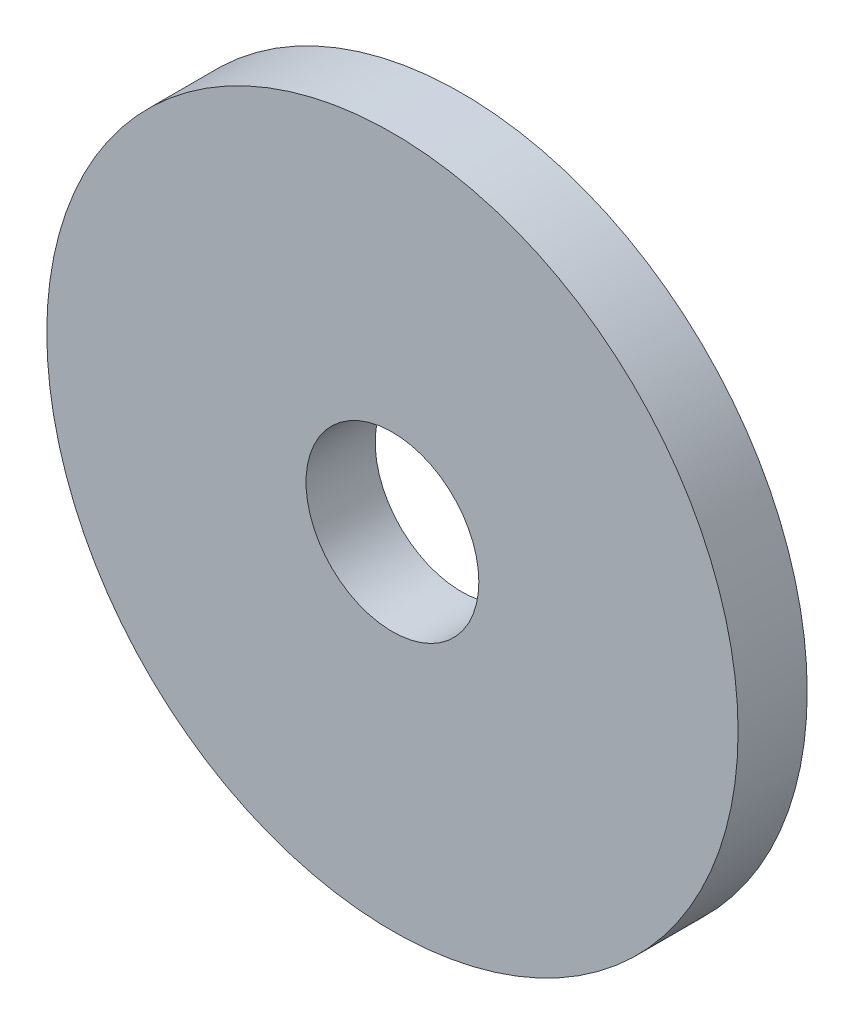
ISO-10303-21;
HEADER;
FILE_DESCRIPTION(('STEP AP214'),'2;1');
FILE_NAME('part.step','',(''),(''),'','','');
FILE_SCHEMA(('AUTOMOTIVE_DESIGN { 1 0 10303 214 1 1 1 1 }'));
ENDSEC;
DATA;
#1=APPLICATION_CONTEXT('core data for automotive mechanical design processes');
#2=APPLICATION_PROTOCOL_DEFINITION('international standard','automotive_design',2000,#1);
#3=PRODUCT_CONTEXT('',#1,'mechanical');
#4=PRODUCT('Part','Part','',(#3));
#5=PRODUCT_RELATED_PRODUCT_CATEGORY('part','',(#4));
#6=PRODUCT_DEFINITION_FORMATION('','',#4);
#7=PRODUCT_DEFINITION_CONTEXT('part definition',#1,'design');
#8=PRODUCT_DEFINITION('design','',#6,#7);
#9=PRODUCT_DEFINITION_SHAPE('','',#8);
#10=(LENGTH_UNIT() NAMED_UNIT(*) SI_UNIT(.MILLI.,.METRE.));
#11=(NAMED_UNIT(*) PLANE_ANGLE_UNIT() SI_UNIT($,.RADIAN.));
#12=(NAMED_UNIT(*) SI_UNIT($,.STERADIAN.) SOLID_ANGLE_UNIT());
#13=UNCERTAINTY_MEASURE_WITH_UNIT(LENGTH_MEASURE(1.E-05),#10,'distance_accuracy_value','');
#14=(GEOMETRIC_REPRESENTATION_CONTEXT(3) GLOBAL_UNCERTAINTY_ASSIGNED_CONTEXT((#13)) GLOBAL_UNIT_ASSIGNED_CONTEXT((#10,
#11,#12)) REPRESENTATION_CONTEXT('',''));
#15=CARTESIAN_POINT('',(0.,0.,0.));
#16=DIRECTION('',(0.,0.,1.));
#17=DIRECTION('',(1.,0.,0.));
#18=AXIS2_PLACEMENT_3D('',#15,#16,#17);
#19=CARTESIAN_POINT('',(0.,0.,4.));
#20=DIRECTION('',(0.,0.,-1.));
#21=DIRECTION('',(-1.,0.,0.));
#22=AXIS2_PLACEMENT_3D('',#19,#20,#21);
#23=CYLINDRICAL_SURFACE('',#22,20.);
#24=CARTESIAN_POINT('',(0.,0.,4.));
#25=DIRECTION('',(0.,0.,1.));
#26=DIRECTION('',(1.,0.,0.));
#27=AXIS2_PLACEMENT_3D('',#24,#25,#26);
#28=CIRCLE('',#27,20.);
#29=CARTESIAN_POINT('',(20.,0.,4.));
#30=VERTEX_POINT('',#29);
#31=EDGE_CURVE('E10',#30,#30,#28,.T.);
#32=ORIENTED_EDGE('',*,*,#31,.F.);
#33=EDGE_LOOP('',(#32));
#34=FACE_BOUND('',#33,.T.);
#35=CARTESIAN_POINT('',(0.,0.,0.));
#36=DIRECTION('',(0.,0.,1.));
#37=DIRECTION('',(1.,0.,0.));
#38=AXIS2_PLACEMENT_3D('',#35,#36,#37);
#39=CIRCLE('',#38,20.);
#40=CARTESIAN_POINT('',(20.,0.,0.));
#41=VERTEX_POINT('',#40);
#42=EDGE_CURVE('E34',#41,#41,#39,.T.);
#43=ORIENTED_EDGE('',*,*,#42,.T.);
#44=EDGE_LOOP('',(#43));
#45=FACE_BOUND('',#44,.T.);
#46=ADVANCED_FACE('F31',(#34,#45),#23,.T.);
#47=CARTESIAN_POINT('',(0.,0.,4.));
#48=DIRECTION('',(0.,0.,1.));
#49=DIRECTION('',(1.,0.,0.));
#50=AXIS2_PLACEMENT_3D('',#47,#48,#49);
#51=PLANE('',#50);
#52=CARTESIAN_POINT('',(0.,0.,4.));
#53=DIRECTION('',(0.,0.,1.));
#54=DIRECTION('',(1.,0.,0.));
#55=AXIS2_PLACEMENT_3D('',#52,#53,#54);
#56=CIRCLE('',#55,5.);
#57=CARTESIAN_POINT('',(5.,0.,4.));
#58=VERTEX_POINT('',#57);
#59=EDGE_CURVE('E43',#58,#58,#56,.T.);
#60=ORIENTED_EDGE('',*,*,#59,.F.);
#61=EDGE_LOOP('',(#60));
#62=FACE_BOUND('',#61,.T.);
#63=ORIENTED_EDGE('',*,*,#31,.T.);
#64=EDGE_LOOP('',(#63));
#65=FACE_BOUND('',#64,.T.);
#66=ADVANCED_FACE('F58',(#62,#65),#51,.T.);
#67=CARTESIAN_POINT('',(0.,0.,0.));
#68=DIRECTION('',(0.,0.,1.));
#69=DIRECTION('',(1.,0.,0.));
#70=AXIS2_PLACEMENT_3D('',#67,#68,#69);
#71=PLANE('',#70);
#72=CARTESIAN_POINT('',(0.,0.,0.));
#73=DIRECTION('',(0.,0.,1.));
#74=DIRECTION('',(1.,0.,0.));
#75=AXIS2_PLACEMENT_3D('',#72,#73,#74);
#76=CIRCLE('',#75,5.);
#77=CARTESIAN_POINT('',(5.,0.,0.));
#78=VERTEX_POINT('',#77);
#79=EDGE_CURVE('E41',#78,#78,#76,.T.);
#80=ORIENTED_EDGE('',*,*,#79,.T.);
#81=EDGE_LOOP('',(#80));
#82=FACE_BOUND('',#81,.T.);
#83=ORIENTED_EDGE('',*,*,#42,.F.);
#84=EDGE_LOOP('',(#83));
#85=FACE_BOUND('',#84,.T.);
#86=ADVANCED_FACE('F49',(#82,#85),#71,.F.);
#87=CARTESIAN_POINT('',(0.,0.,0.));
#88=DIRECTION('',(0.,0.,1.));
#89=DIRECTION('',(1.,0.,0.));
#90=AXIS2_PLACEMENT_3D('',#87,#88,#89);
#91=CYLINDRICAL_SURFACE('',#90,5.);
#92=ORIENTED_EDGE('',*,*,#79,.F.);
#93=EDGE_LOOP('',(#92));
#94=FACE_BOUND('',#93,.T.);
#95=ORIENTED_EDGE('',*,*,#59,.T.);
#96=EDGE_LOOP('',(#95));
#97=FACE_BOUND('',#96,.T.);
#98=ADVANCED_FACE('F52',(#94,#97),#91,.F.);
#99=CLOSED_SHELL('',(#46,#66,#86,#98));
#100=MANIFOLD_SOLID_BREP('B2',#99);
#101=ADVANCED_BREP_SHAPE_REPRESENTATION('',(#18,#100),#14);
#102=SHAPE_DEFINITION_REPRESENTATION(#9,#101);
ENDSEC;
END-ISO-10303-21;
